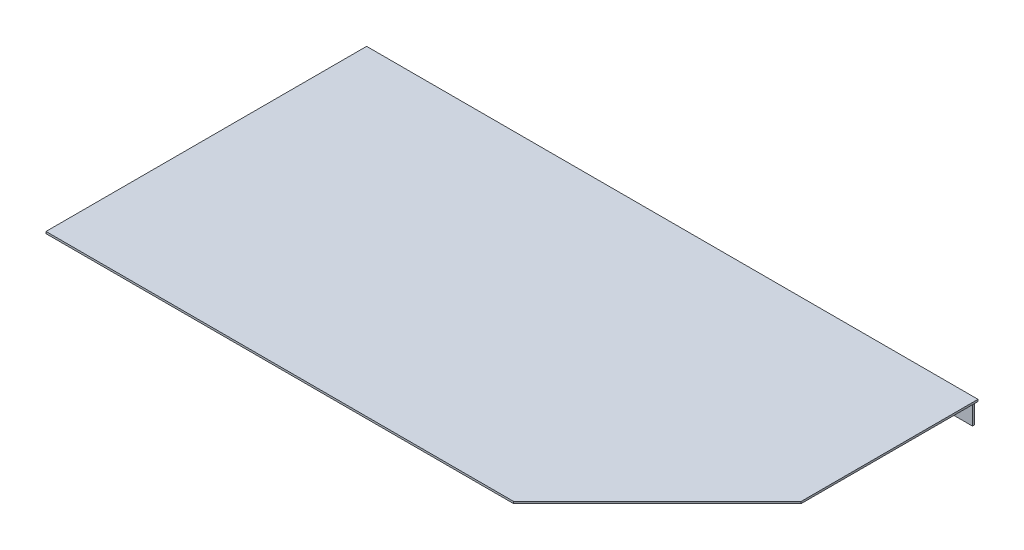
ISO-10303-21;
HEADER;
FILE_DESCRIPTION(('STEP AP214'),'2;1');
FILE_NAME('part.step','',(''),(''),'','','');
FILE_SCHEMA(('AUTOMOTIVE_DESIGN { 1 0 10303 214 1 1 1 1 }'));
ENDSEC;
DATA;
#1=APPLICATION_CONTEXT('core data for automotive mechanical design processes');
#2=APPLICATION_PROTOCOL_DEFINITION('international standard','automotive_design',2000,#1);
#3=PRODUCT_CONTEXT('',#1,'mechanical');
#4=PRODUCT('Part','Part','',(#3));
#5=PRODUCT_RELATED_PRODUCT_CATEGORY('part','',(#4));
#6=PRODUCT_DEFINITION_FORMATION('','',#4);
#7=PRODUCT_DEFINITION_CONTEXT('part definition',#1,'design');
#8=PRODUCT_DEFINITION('design','',#6,#7);
#9=PRODUCT_DEFINITION_SHAPE('','',#8);
#10=(LENGTH_UNIT() NAMED_UNIT(*) SI_UNIT(.MILLI.,.METRE.));
#11=(NAMED_UNIT(*) PLANE_ANGLE_UNIT() SI_UNIT($,.RADIAN.));
#12=(NAMED_UNIT(*) SI_UNIT($,.STERADIAN.) SOLID_ANGLE_UNIT());
#13=UNCERTAINTY_MEASURE_WITH_UNIT(LENGTH_MEASURE(1.E-05),#10,'distance_accuracy_value','');
#14=(GEOMETRIC_REPRESENTATION_CONTEXT(3) GLOBAL_UNCERTAINTY_ASSIGNED_CONTEXT((#13)) GLOBAL_UNIT_ASSIGNED_CONTEXT((#10,
#11,#12)) REPRESENTATION_CONTEXT('',''));
#15=CARTESIAN_POINT('',(0.,0.,0.));
#16=DIRECTION('',(0.,0.,1.));
#17=DIRECTION('',(1.,0.,0.));
#18=AXIS2_PLACEMENT_3D('',#15,#16,#17);
#19=CARTESIAN_POINT('',(276.5,-1.75,290.));
#20=DIRECTION('',(0.,1.,0.));
#21=DIRECTION('',(-1.,0.,0.));
#22=AXIS2_PLACEMENT_3D('',#19,#20,#21);
#23=PLANE('',#22);
#24=DIRECTION('',(0.,0.,-1.));
#25=VECTOR('',#24,1.);
#26=CARTESIAN_POINT('',(-274.75,-1.75000000000007,0.));
#27=LINE('',#26,#25);
#28=CARTESIAN_POINT('',(-274.75,-1.75000000000007,1.74999999999993));
#29=VERTEX_POINT('',#28);
#30=CARTESIAN_POINT('',(-274.75,-1.75000000000007,0.));
#31=VERTEX_POINT('',#30);
#32=EDGE_CURVE('E48',#29,#31,#27,.T.);
#33=ORIENTED_EDGE('',*,*,#32,.F.);
#34=DIRECTION('',(-1.,0.,0.));
#35=VECTOR('',#34,1.);
#36=CARTESIAN_POINT('',(-274.75,-1.75000000000007,1.74999999999993));
#37=LINE('',#36,#35);
#38=CARTESIAN_POINT('',(273.25,-1.75,1.74999999999993));
#39=VERTEX_POINT('',#38);
#40=EDGE_CURVE('E191',#39,#29,#37,.T.);
#41=ORIENTED_EDGE('',*,*,#40,.F.);
#42=DIRECTION('',(0.,0.,1.));
#43=VECTOR('',#42,1.);
#44=CARTESIAN_POINT('',(273.25,-1.75,1.74999999999993));
#45=LINE('',#44,#43);
#46=CARTESIAN_POINT('',(273.25,-1.75,0.));
#47=VERTEX_POINT('',#46);
#48=EDGE_CURVE('E54',#47,#39,#45,.T.);
#49=ORIENTED_EDGE('',*,*,#48,.F.);
#50=DIRECTION('',(1.,0.,0.));
#51=VECTOR('',#50,1.);
#52=CARTESIAN_POINT('',(276.5,-1.75,0.));
#53=LINE('',#52,#51);
#54=CARTESIAN_POINT('',(276.5,-1.75,0.));
#55=VERTEX_POINT('',#54);
#56=EDGE_CURVE('E125',#47,#55,#53,.T.);
#57=ORIENTED_EDGE('',*,*,#56,.T.);
#58=DIRECTION('',(0.,0.,-1.));
#59=VECTOR('',#58,1.);
#60=CARTESIAN_POINT('',(276.5,-1.75,290.));
#61=LINE('',#60,#59);
#62=CARTESIAN_POINT('',(276.5,-1.75,160.));
#63=VERTEX_POINT('',#62);
#64=EDGE_CURVE('E41',#63,#55,#61,.T.);
#65=ORIENTED_EDGE('',*,*,#64,.F.);
#66=DIRECTION('',(-0.707106781186548,0.,0.707106781186548));
#67=VECTOR('',#66,1.);
#68=CARTESIAN_POINT('',(211.5,-1.75000000000001,225.));
#69=LINE('',#68,#67);
#70=CARTESIAN_POINT('',(146.5,-1.75000000000007,290.));
#71=VERTEX_POINT('',#70);
#72=EDGE_CURVE('E135',#63,#71,#69,.T.);
#73=ORIENTED_EDGE('',*,*,#72,.T.);
#74=DIRECTION('',(1.,0.,0.));
#75=VECTOR('',#74,1.);
#76=CARTESIAN_POINT('',(276.5,-1.75,290.));
#77=LINE('',#76,#75);
#78=CARTESIAN_POINT('',(-276.5,-1.75000000000007,290.));
#79=VERTEX_POINT('',#78);
#80=EDGE_CURVE('E138',#79,#71,#77,.T.);
#81=ORIENTED_EDGE('',*,*,#80,.F.);
#82=DIRECTION('',(0.,0.,-1.));
#83=VECTOR('',#82,1.);
#84=CARTESIAN_POINT('',(-276.5,-1.75000000000007,290.));
#85=LINE('',#84,#83);
#86=CARTESIAN_POINT('',(-276.5,-1.75000000000007,0.));
#87=VERTEX_POINT('',#86);
#88=EDGE_CURVE('E146',#79,#87,#85,.T.);
#89=ORIENTED_EDGE('',*,*,#88,.T.);
#90=EDGE_CURVE('E147',#87,#31,#53,.T.);
#91=ORIENTED_EDGE('',*,*,#90,.T.);
#92=EDGE_LOOP('',(#33,#41,#49,#57,#65,#73,#81,#89,#91));
#93=FACE_BOUND('',#92,.T.);
#94=ADVANCED_FACE('F34',(#93),#23,.F.);
#95=CARTESIAN_POINT('',(276.5,1.01584451989273E-13,290.));
#96=DIRECTION('',(-1.,0.,0.));
#97=DIRECTION('',(0.,0.,1.));
#98=AXIS2_PLACEMENT_3D('',#95,#96,#97);
#99=PLANE('',#98);
#100=DIRECTION('',(0.,0.,-1.));
#101=VECTOR('',#100,1.);
#102=CARTESIAN_POINT('',(276.5,1.01584451989273E-13,290.));
#103=LINE('',#102,#101);
#104=CARTESIAN_POINT('',(276.5,0.,160.));
#105=VERTEX_POINT('',#104);
#106=CARTESIAN_POINT('',(276.5,1.01584451989273E-13,0.));
#107=VERTEX_POINT('',#106);
#108=EDGE_CURVE('E160',#105,#107,#103,.T.);
#109=ORIENTED_EDGE('',*,*,#108,.F.);
#110=DIRECTION('',(0.,1.,0.));
#111=VECTOR('',#110,1.);
#112=CARTESIAN_POINT('',(276.5,-9.99999999999995,160.));
#113=LINE('',#112,#111);
#114=EDGE_CURVE('E128',#63,#105,#113,.T.);
#115=ORIENTED_EDGE('',*,*,#114,.F.);
#116=ORIENTED_EDGE('',*,*,#64,.T.);
#117=DIRECTION('',(0.,1.,0.));
#118=VECTOR('',#117,1.);
#119=CARTESIAN_POINT('',(276.5,1.01584451989273E-13,0.));
#120=LINE('',#119,#118);
#121=EDGE_CURVE('E149',#55,#107,#120,.T.);
#122=ORIENTED_EDGE('',*,*,#121,.T.);
#123=EDGE_LOOP('',(#109,#115,#116,#122));
#124=FACE_BOUND('',#123,.T.);
#125=ADVANCED_FACE('F166',(#124),#99,.F.);
#126=CARTESIAN_POINT('',(-276.5,0.,290.));
#127=DIRECTION('',(0.,-1.,0.));
#128=DIRECTION('',(1.,0.,0.));
#129=AXIS2_PLACEMENT_3D('',#126,#127,#128);
#130=PLANE('',#129);
#131=DIRECTION('',(-1.,0.,0.));
#132=VECTOR('',#131,1.);
#133=CARTESIAN_POINT('',(-276.5,0.,290.));
#134=LINE('',#133,#132);
#135=CARTESIAN_POINT('',(146.5,0.,290.));
#136=VERTEX_POINT('',#135);
#137=CARTESIAN_POINT('',(-276.5,0.,290.));
#138=VERTEX_POINT('',#137);
#139=EDGE_CURVE('E141',#136,#138,#134,.T.);
#140=ORIENTED_EDGE('',*,*,#139,.F.);
#141=DIRECTION('',(-0.707106781186547,0.,0.707106781186547));
#142=VECTOR('',#141,1.);
#143=CARTESIAN_POINT('',(146.5,0.,290.));
#144=LINE('',#143,#142);
#145=EDGE_CURVE('E126',#105,#136,#144,.T.);
#146=ORIENTED_EDGE('',*,*,#145,.F.);
#147=ORIENTED_EDGE('',*,*,#108,.T.);
#148=DIRECTION('',(-1.,0.,0.));
#149=VECTOR('',#148,1.);
#150=CARTESIAN_POINT('',(-276.5,0.,0.));
#151=LINE('',#150,#149);
#152=CARTESIAN_POINT('',(-276.5,0.,0.));
#153=VERTEX_POINT('',#152);
#154=EDGE_CURVE('E152',#107,#153,#151,.T.);
#155=ORIENTED_EDGE('',*,*,#154,.T.);
#156=DIRECTION('',(0.,0.,-1.));
#157=VECTOR('',#156,1.);
#158=CARTESIAN_POINT('',(-276.5,0.,290.));
#159=LINE('',#158,#157);
#160=EDGE_CURVE('E157',#138,#153,#159,.T.);
#161=ORIENTED_EDGE('',*,*,#160,.F.);
#162=EDGE_LOOP('',(#140,#146,#147,#155,#161));
#163=FACE_BOUND('',#162,.T.);
#164=ADVANCED_FACE('F172',(#163),#130,.F.);
#165=CARTESIAN_POINT('',(-276.5,0.,290.));
#166=DIRECTION('',(1.,0.,0.));
#167=DIRECTION('',(0.,0.,-1.));
#168=AXIS2_PLACEMENT_3D('',#165,#166,#167);
#169=PLANE('',#168);
#170=DIRECTION('',(0.,-1.,0.));
#171=VECTOR('',#170,1.);
#172=CARTESIAN_POINT('',(-276.5,0.,0.));
#173=LINE('',#172,#171);
#174=EDGE_CURVE('E142',#153,#87,#173,.T.);
#175=ORIENTED_EDGE('',*,*,#174,.T.);
#176=ORIENTED_EDGE('',*,*,#88,.F.);
#177=DIRECTION('',(0.,-1.,0.));
#178=VECTOR('',#177,1.);
#179=CARTESIAN_POINT('',(-276.5,0.,290.));
#180=LINE('',#179,#178);
#181=EDGE_CURVE('E144',#138,#79,#180,.T.);
#182=ORIENTED_EDGE('',*,*,#181,.F.);
#183=ORIENTED_EDGE('',*,*,#160,.T.);
#184=EDGE_LOOP('',(#175,#176,#182,#183));
#185=FACE_BOUND('',#184,.T.);
#186=ADVANCED_FACE('F176',(#185),#169,.F.);
#187=CARTESIAN_POINT('',(0.,0.,290.));
#188=DIRECTION('',(0.,0.,1.));
#189=DIRECTION('',(1.,0.,0.));
#190=AXIS2_PLACEMENT_3D('',#187,#188,#189);
#191=PLANE('',#190);
#192=DIRECTION('',(0.,-1.,0.));
#193=VECTOR('',#192,1.);
#194=CARTESIAN_POINT('',(146.5,0.,290.));
#195=LINE('',#194,#193);
#196=EDGE_CURVE('E11',#136,#71,#195,.T.);
#197=ORIENTED_EDGE('',*,*,#196,.F.);
#198=ORIENTED_EDGE('',*,*,#139,.T.);
#199=ORIENTED_EDGE('',*,*,#181,.T.);
#200=ORIENTED_EDGE('',*,*,#80,.T.);
#201=EDGE_LOOP('',(#197,#198,#199,#200));
#202=FACE_BOUND('',#201,.T.);
#203=ADVANCED_FACE('F181',(#202),#191,.T.);
#204=CARTESIAN_POINT('',(0.,0.,0.));
#205=DIRECTION('',(0.,0.,1.));
#206=DIRECTION('',(1.,0.,0.));
#207=AXIS2_PLACEMENT_3D('',#204,#205,#206);
#208=PLANE('',#207);
#209=ORIENTED_EDGE('',*,*,#90,.F.);
#210=ORIENTED_EDGE('',*,*,#174,.F.);
#211=ORIENTED_EDGE('',*,*,#154,.F.);
#212=ORIENTED_EDGE('',*,*,#121,.F.);
#213=ORIENTED_EDGE('',*,*,#56,.F.);
#214=DIRECTION('',(0.,1.,0.));
#215=VECTOR('',#214,1.);
#216=CARTESIAN_POINT('',(273.25,-21.75,0.));
#217=LINE('',#216,#215);
#218=CARTESIAN_POINT('',(273.25,-21.75,0.));
#219=VERTEX_POINT('',#218);
#220=EDGE_CURVE('E106',#219,#47,#217,.T.);
#221=ORIENTED_EDGE('',*,*,#220,.F.);
#222=DIRECTION('',(1.,0.,0.));
#223=VECTOR('',#222,1.);
#224=CARTESIAN_POINT('',(273.25,-21.75,0.));
#225=LINE('',#224,#223);
#226=CARTESIAN_POINT('',(-274.75,-21.7500000000001,0.));
#227=VERTEX_POINT('',#226);
#228=EDGE_CURVE('E112',#227,#219,#225,.T.);
#229=ORIENTED_EDGE('',*,*,#228,.F.);
#230=DIRECTION('',(0.,1.,0.));
#231=VECTOR('',#230,1.);
#232=CARTESIAN_POINT('',(-274.75,-21.7500000000001,0.));
#233=LINE('',#232,#231);
#234=EDGE_CURVE('E184',#227,#31,#233,.T.);
#235=ORIENTED_EDGE('',*,*,#234,.T.);
#236=EDGE_LOOP('',(#209,#210,#211,#212,#213,#221,#229,#235));
#237=FACE_BOUND('',#236,.T.);
#238=ADVANCED_FACE('F123',(#237),#208,.F.);
#239=CARTESIAN_POINT('',(146.5,-9.99999999999997,290.));
#240=DIRECTION('',(-0.707106781186548,0.,-0.707106781186548));
#241=DIRECTION('',(-0.707106781186548,0.,0.707106781186548));
#242=AXIS2_PLACEMENT_3D('',#239,#240,#241);
#243=PLANE('',#242);
#244=ORIENTED_EDGE('',*,*,#114,.T.);
#245=ORIENTED_EDGE('',*,*,#145,.T.);
#246=ORIENTED_EDGE('',*,*,#196,.T.);
#247=ORIENTED_EDGE('',*,*,#72,.F.);
#248=EDGE_LOOP('',(#244,#245,#246,#247));
#249=FACE_BOUND('',#248,.T.);
#250=ADVANCED_FACE('F183',(#249),#243,.F.);
#251=CARTESIAN_POINT('',(273.25,-21.75,1.74999999999993));
#252=DIRECTION('',(-1.,0.,0.));
#253=DIRECTION('',(0.,-1.,0.));
#254=AXIS2_PLACEMENT_3D('',#251,#252,#253);
#255=PLANE('',#254);
#256=ORIENTED_EDGE('',*,*,#48,.T.);
#257=DIRECTION('',(0.,1.,0.));
#258=VECTOR('',#257,1.);
#259=CARTESIAN_POINT('',(273.25,-21.75,1.74999999999993));
#260=LINE('',#259,#258);
#261=CARTESIAN_POINT('',(273.25,-21.75,1.74999999999993));
#262=VERTEX_POINT('',#261);
#263=EDGE_CURVE('E108',#262,#39,#260,.T.);
#264=ORIENTED_EDGE('',*,*,#263,.F.);
#265=DIRECTION('',(0.,0.,1.));
#266=VECTOR('',#265,1.);
#267=CARTESIAN_POINT('',(273.25,-21.75,1.74999999999993));
#268=LINE('',#267,#266);
#269=EDGE_CURVE('E102',#219,#262,#268,.T.);
#270=ORIENTED_EDGE('',*,*,#269,.F.);
#271=ORIENTED_EDGE('',*,*,#220,.T.);
#272=EDGE_LOOP('',(#256,#264,#270,#271));
#273=FACE_BOUND('',#272,.T.);
#274=ADVANCED_FACE('F104',(#273),#255,.F.);
#275=CARTESIAN_POINT('',(-274.75,-21.7500000000001,1.74999999999993));
#276=DIRECTION('',(0.,0.,-1.));
#277=DIRECTION('',(-1.,0.,0.));
#278=AXIS2_PLACEMENT_3D('',#275,#276,#277);
#279=PLANE('',#278);
#280=ORIENTED_EDGE('',*,*,#40,.T.);
#281=DIRECTION('',(0.,1.,0.));
#282=VECTOR('',#281,1.);
#283=CARTESIAN_POINT('',(-274.75,-21.7500000000001,1.74999999999993));
#284=LINE('',#283,#282);
#285=CARTESIAN_POINT('',(-274.75,-21.7500000000001,1.74999999999993));
#286=VERTEX_POINT('',#285);
#287=EDGE_CURVE('E130',#286,#29,#284,.T.);
#288=ORIENTED_EDGE('',*,*,#287,.F.);
#289=DIRECTION('',(-1.,0.,0.));
#290=VECTOR('',#289,1.);
#291=CARTESIAN_POINT('',(-274.75,-21.7500000000001,1.74999999999993));
#292=LINE('',#291,#290);
#293=EDGE_CURVE('E111',#262,#286,#292,.T.);
#294=ORIENTED_EDGE('',*,*,#293,.F.);
#295=ORIENTED_EDGE('',*,*,#263,.T.);
#296=EDGE_LOOP('',(#280,#288,#294,#295));
#297=FACE_BOUND('',#296,.T.);
#298=ADVANCED_FACE('F196',(#297),#279,.F.);
#299=CARTESIAN_POINT('',(-274.75,-21.7500000000001,0.));
#300=DIRECTION('',(1.,0.,0.));
#301=DIRECTION('',(0.,1.,0.));
#302=AXIS2_PLACEMENT_3D('',#299,#300,#301);
#303=PLANE('',#302);
#304=ORIENTED_EDGE('',*,*,#32,.T.);
#305=ORIENTED_EDGE('',*,*,#234,.F.);
#306=DIRECTION('',(0.,0.,-1.));
#307=VECTOR('',#306,1.);
#308=CARTESIAN_POINT('',(-274.75,-21.7500000000001,0.));
#309=LINE('',#308,#307);
#310=EDGE_CURVE('E117',#286,#227,#309,.T.);
#311=ORIENTED_EDGE('',*,*,#310,.F.);
#312=ORIENTED_EDGE('',*,*,#287,.T.);
#313=EDGE_LOOP('',(#304,#305,#311,#312));
#314=FACE_BOUND('',#313,.T.);
#315=ADVANCED_FACE('F197',(#314),#303,.F.);
#316=CARTESIAN_POINT('',(0.,-21.75,0.));
#317=DIRECTION('',(0.,1.,0.));
#318=DIRECTION('',(-1.,0.,0.));
#319=AXIS2_PLACEMENT_3D('',#316,#317,#318);
#320=PLANE('',#319);
#321=ORIENTED_EDGE('',*,*,#228,.T.);
#322=ORIENTED_EDGE('',*,*,#269,.T.);
#323=ORIENTED_EDGE('',*,*,#293,.T.);
#324=ORIENTED_EDGE('',*,*,#310,.T.);
#325=EDGE_LOOP('',(#321,#322,#323,#324));
#326=FACE_BOUND('',#325,.T.);
#327=ADVANCED_FACE('F115',(#326),#320,.F.);
#328=CLOSED_SHELL('',(#94,#125,#164,#186,#203,#238,#250,#274,#298,#315,#327));
#329=MANIFOLD_SOLID_BREP('B2',#328);
#330=ADVANCED_BREP_SHAPE_REPRESENTATION('',(#18,#329),#14);
#331=SHAPE_DEFINITION_REPRESENTATION(#9,#330);
ENDSEC;
END-ISO-10303-21;
